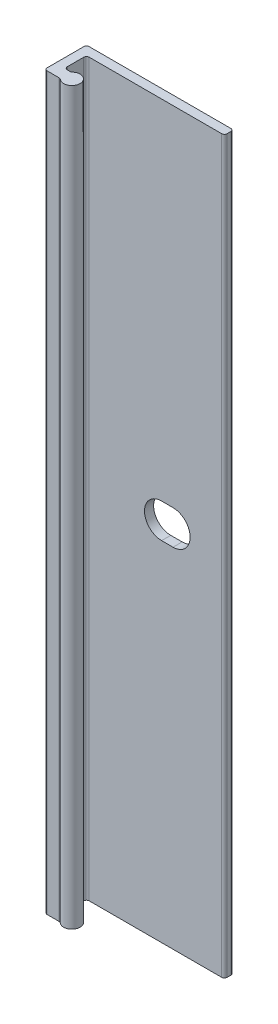
ISO-10303-21;
HEADER;
FILE_DESCRIPTION(('STEP AP214'),'2;1');
FILE_NAME('part.step','',(''),(''),'','','');
FILE_SCHEMA(('AUTOMOTIVE_DESIGN { 1 0 10303 214 1 1 1 1 }'));
ENDSEC;
DATA;
#1=APPLICATION_CONTEXT('core data for automotive mechanical design processes');
#2=APPLICATION_PROTOCOL_DEFINITION('international standard','automotive_design',2000,#1);
#3=PRODUCT_CONTEXT('',#1,'mechanical');
#4=PRODUCT('Part','Part','',(#3));
#5=PRODUCT_RELATED_PRODUCT_CATEGORY('part','',(#4));
#6=PRODUCT_DEFINITION_FORMATION('','',#4);
#7=PRODUCT_DEFINITION_CONTEXT('part definition',#1,'design');
#8=PRODUCT_DEFINITION('design','',#6,#7);
#9=PRODUCT_DEFINITION_SHAPE('','',#8);
#10=(LENGTH_UNIT() NAMED_UNIT(*) SI_UNIT(.MILLI.,.METRE.));
#11=(NAMED_UNIT(*) PLANE_ANGLE_UNIT() SI_UNIT($,.RADIAN.));
#12=(NAMED_UNIT(*) SI_UNIT($,.STERADIAN.) SOLID_ANGLE_UNIT());
#13=UNCERTAINTY_MEASURE_WITH_UNIT(LENGTH_MEASURE(1.E-05),#10,'distance_accuracy_value','');
#14=(GEOMETRIC_REPRESENTATION_CONTEXT(3) GLOBAL_UNCERTAINTY_ASSIGNED_CONTEXT((#13)) GLOBAL_UNIT_ASSIGNED_CONTEXT((#10,
#11,#12)) REPRESENTATION_CONTEXT('',''));
#15=CARTESIAN_POINT('',(0.,0.,0.));
#16=DIRECTION('',(0.,0.,1.));
#17=DIRECTION('',(1.,0.,0.));
#18=AXIS2_PLACEMENT_3D('',#15,#16,#17);
#19=CARTESIAN_POINT('',(0.381000000000001,50.8,5.461));
#20=DIRECTION('',(0.,-1.,0.));
#21=DIRECTION('',(0.,0.,-1.));
#22=AXIS2_PLACEMENT_3D('',#19,#20,#21);
#23=CYLINDRICAL_SURFACE('',#22,0.381);
#24=CARTESIAN_POINT('',(0.381000000000001,-50.8,5.461));
#25=DIRECTION('',(0.,1.,0.));
#26=DIRECTION('',(0.,0.,-1.));
#27=AXIS2_PLACEMENT_3D('',#24,#25,#26);
#28=CIRCLE('',#27,0.381);
#29=CARTESIAN_POINT('',(0.,-50.8,5.461));
#30=VERTEX_POINT('',#29);
#31=CARTESIAN_POINT('',(0.381000000000004,-50.8,5.842));
#32=VERTEX_POINT('',#31);
#33=EDGE_CURVE('E215',#30,#32,#28,.T.);
#34=ORIENTED_EDGE('',*,*,#33,.T.);
#35=DIRECTION('',(0.,-1.,0.));
#36=VECTOR('',#35,1.);
#37=CARTESIAN_POINT('',(0.381000000000004,50.8,5.842));
#38=LINE('',#37,#36);
#39=CARTESIAN_POINT('',(0.381000000000004,50.8,5.842));
#40=VERTEX_POINT('',#39);
#41=EDGE_CURVE('E13',#40,#32,#38,.T.);
#42=ORIENTED_EDGE('',*,*,#41,.F.);
#43=CARTESIAN_POINT('',(0.381000000000001,50.8,5.461));
#44=DIRECTION('',(0.,1.,0.));
#45=DIRECTION('',(0.,0.,-1.));
#46=AXIS2_PLACEMENT_3D('',#43,#44,#45);
#47=CIRCLE('',#46,0.381);
#48=CARTESIAN_POINT('',(0.,50.8,5.461));
#49=VERTEX_POINT('',#48);
#50=EDGE_CURVE('E219',#49,#40,#47,.T.);
#51=ORIENTED_EDGE('',*,*,#50,.F.);
#52=DIRECTION('',(0.,-1.,0.));
#53=VECTOR('',#52,1.);
#54=CARTESIAN_POINT('',(0.,50.8,5.461));
#55=LINE('',#54,#53);
#56=EDGE_CURVE('E253',#49,#30,#55,.T.);
#57=ORIENTED_EDGE('',*,*,#56,.T.);
#58=EDGE_LOOP('',(#34,#42,#51,#57));
#59=FACE_BOUND('',#58,.T.);
#60=ADVANCED_FACE('F46',(#59),#23,.T.);
#61=CARTESIAN_POINT('',(0.381000000000004,50.8,5.842));
#62=DIRECTION('',(0.,0.,-1.));
#63=DIRECTION('',(-1.,0.,0.));
#64=AXIS2_PLACEMENT_3D('',#61,#62,#63);
#65=PLANE('',#64);
#66=DIRECTION('',(1.,0.,0.));
#67=VECTOR('',#66,1.);
#68=CARTESIAN_POINT('',(0.381000000000004,-50.8,5.842));
#69=LINE('',#68,#67);
#70=CARTESIAN_POINT('',(2.03996875048439,-50.8,5.842));
#71=VERTEX_POINT('',#70);
#72=EDGE_CURVE('E256',#32,#71,#69,.T.);
#73=ORIENTED_EDGE('',*,*,#72,.T.);
#74=DIRECTION('',(0.,-1.,0.));
#75=VECTOR('',#74,1.);
#76=CARTESIAN_POINT('',(2.03996875048439,50.8,5.842));
#77=LINE('',#76,#75);
#78=CARTESIAN_POINT('',(2.03996875048439,50.8,5.842));
#79=VERTEX_POINT('',#78);
#80=EDGE_CURVE('E53',#79,#71,#77,.T.);
#81=ORIENTED_EDGE('',*,*,#80,.F.);
#82=DIRECTION('',(1.,0.,0.));
#83=VECTOR('',#82,1.);
#84=CARTESIAN_POINT('',(0.381000000000004,50.8,5.842));
#85=LINE('',#84,#83);
#86=EDGE_CURVE('E222',#40,#79,#85,.T.);
#87=ORIENTED_EDGE('',*,*,#86,.F.);
#88=ORIENTED_EDGE('',*,*,#41,.T.);
#89=EDGE_LOOP('',(#73,#81,#87,#88));
#90=FACE_BOUND('',#89,.T.);
#91=ADVANCED_FACE('F353',(#90),#65,.F.);
#92=CARTESIAN_POINT('',(2.03996875048439,50.8,6.223));
#93=DIRECTION('',(0.,-1.,0.));
#94=DIRECTION('',(0.,0.,-1.));
#95=AXIS2_PLACEMENT_3D('',#92,#93,#94);
#96=CYLINDRICAL_SURFACE('',#95,0.381);
#97=CARTESIAN_POINT('',(2.03996875048439,-50.8,6.223));
#98=DIRECTION('',(0.,-1.,0.));
#99=DIRECTION('',(0.,0.,-1.));
#100=AXIS2_PLACEMENT_3D('',#97,#98,#99);
#101=CIRCLE('',#100,0.381);
#102=CARTESIAN_POINT('',(2.29197656286329,-50.8,5.93725));
#103=VERTEX_POINT('',#102);
#104=EDGE_CURVE('E258',#71,#103,#101,.T.);
#105=ORIENTED_EDGE('',*,*,#104,.T.);
#106=DIRECTION('',(0.,-1.,0.));
#107=VECTOR('',#106,1.);
#108=CARTESIAN_POINT('',(2.29197656286329,50.8,5.93725));
#109=LINE('',#108,#107);
#110=CARTESIAN_POINT('',(2.29197656286329,50.8,5.93725));
#111=VERTEX_POINT('',#110);
#112=EDGE_CURVE('E323',#111,#103,#109,.T.);
#113=ORIENTED_EDGE('',*,*,#112,.F.);
#114=CARTESIAN_POINT('',(2.03996875048439,50.8,6.223));
#115=DIRECTION('',(0.,-1.,0.));
#116=DIRECTION('',(0.,0.,-1.));
#117=AXIS2_PLACEMENT_3D('',#114,#115,#116);
#118=CIRCLE('',#117,0.381);
#119=EDGE_CURVE('E225',#79,#111,#118,.T.);
#120=ORIENTED_EDGE('',*,*,#119,.F.);
#121=ORIENTED_EDGE('',*,*,#80,.T.);
#122=EDGE_LOOP('',(#105,#113,#120,#121));
#123=FACE_BOUND('',#122,.T.);
#124=ADVANCED_FACE('F330',(#123),#96,.F.);
#125=CARTESIAN_POINT('',(3.048,50.8,5.08));
#126=DIRECTION('',(0.,-1.,0.));
#127=DIRECTION('',(0.,0.,-1.));
#128=AXIS2_PLACEMENT_3D('',#125,#126,#127);
#129=CYLINDRICAL_SURFACE('',#128,1.143);
#130=CARTESIAN_POINT('',(3.048,-50.8,5.08));
#131=DIRECTION('',(0.,1.,0.));
#132=DIRECTION('',(0.,0.,1.));
#133=AXIS2_PLACEMENT_3D('',#130,#131,#132);
#134=CIRCLE('',#133,1.143);
#135=CARTESIAN_POINT('',(2.2919765628633,-50.8,4.22275));
#136=VERTEX_POINT('',#135);
#137=EDGE_CURVE('E260',#103,#136,#134,.T.);
#138=ORIENTED_EDGE('',*,*,#137,.T.);
#139=DIRECTION('',(0.,-1.,0.));
#140=VECTOR('',#139,1.);
#141=CARTESIAN_POINT('',(2.2919765628633,50.8,4.22275));
#142=LINE('',#141,#140);
#143=CARTESIAN_POINT('',(2.2919765628633,50.8,4.22275));
#144=VERTEX_POINT('',#143);
#145=EDGE_CURVE('E320',#144,#136,#142,.T.);
#146=ORIENTED_EDGE('',*,*,#145,.F.);
#147=CARTESIAN_POINT('',(3.048,50.8,5.08));
#148=DIRECTION('',(0.,1.,0.));
#149=DIRECTION('',(0.,0.,1.));
#150=AXIS2_PLACEMENT_3D('',#147,#148,#149);
#151=CIRCLE('',#150,1.143);
#152=EDGE_CURVE('E227',#111,#144,#151,.T.);
#153=ORIENTED_EDGE('',*,*,#152,.F.);
#154=ORIENTED_EDGE('',*,*,#112,.T.);
#155=EDGE_LOOP('',(#138,#146,#153,#154));
#156=FACE_BOUND('',#155,.T.);
#157=ADVANCED_FACE('F341',(#156),#129,.T.);
#158=CARTESIAN_POINT('',(2.03996875048439,50.8,3.937));
#159=DIRECTION('',(0.,-1.,0.));
#160=DIRECTION('',(0.,0.,-1.));
#161=AXIS2_PLACEMENT_3D('',#158,#159,#160);
#162=CYLINDRICAL_SURFACE('',#161,0.381000000000001);
#163=CARTESIAN_POINT('',(2.03996875048439,-50.8,3.937));
#164=DIRECTION('',(0.,-1.,0.));
#165=DIRECTION('',(0.,0.,-1.));
#166=AXIS2_PLACEMENT_3D('',#163,#164,#165);
#167=CIRCLE('',#166,0.381000000000001);
#168=CARTESIAN_POINT('',(2.03996875048439,-50.8,4.318));
#169=VERTEX_POINT('',#168);
#170=EDGE_CURVE('E262',#136,#169,#167,.T.);
#171=ORIENTED_EDGE('',*,*,#170,.T.);
#172=DIRECTION('',(0.,-1.,0.));
#173=VECTOR('',#172,1.);
#174=CARTESIAN_POINT('',(2.03996875048439,50.8,4.318));
#175=LINE('',#174,#173);
#176=CARTESIAN_POINT('',(2.03996875048439,50.8,4.318));
#177=VERTEX_POINT('',#176);
#178=EDGE_CURVE('E317',#177,#169,#175,.T.);
#179=ORIENTED_EDGE('',*,*,#178,.F.);
#180=CARTESIAN_POINT('',(2.03996875048439,50.8,3.937));
#181=DIRECTION('',(0.,-1.,0.));
#182=DIRECTION('',(0.,0.,-1.));
#183=AXIS2_PLACEMENT_3D('',#180,#181,#182);
#184=CIRCLE('',#183,0.381000000000001);
#185=EDGE_CURVE('E229',#144,#177,#184,.T.);
#186=ORIENTED_EDGE('',*,*,#185,.F.);
#187=ORIENTED_EDGE('',*,*,#145,.T.);
#188=EDGE_LOOP('',(#171,#179,#186,#187));
#189=FACE_BOUND('',#188,.T.);
#190=ADVANCED_FACE('F345',(#189),#162,.F.);
#191=CARTESIAN_POINT('',(1.651,50.8,4.318));
#192=DIRECTION('',(0.,0.,1.));
#193=DIRECTION('',(1.,0.,0.));
#194=AXIS2_PLACEMENT_3D('',#191,#192,#193);
#195=PLANE('',#194);
#196=DIRECTION('',(-1.,0.,0.));
#197=VECTOR('',#196,1.);
#198=CARTESIAN_POINT('',(1.651,-50.8,4.318));
#199=LINE('',#198,#197);
#200=CARTESIAN_POINT('',(1.651,-50.8,4.318));
#201=VERTEX_POINT('',#200);
#202=EDGE_CURVE('E264',#169,#201,#199,.T.);
#203=ORIENTED_EDGE('',*,*,#202,.T.);
#204=DIRECTION('',(0.,-1.,0.));
#205=VECTOR('',#204,1.);
#206=CARTESIAN_POINT('',(1.651,50.8,4.318));
#207=LINE('',#206,#205);
#208=CARTESIAN_POINT('',(1.651,50.8,4.318));
#209=VERTEX_POINT('',#208);
#210=EDGE_CURVE('E314',#209,#201,#207,.T.);
#211=ORIENTED_EDGE('',*,*,#210,.F.);
#212=DIRECTION('',(-1.,0.,0.));
#213=VECTOR('',#212,1.);
#214=CARTESIAN_POINT('',(1.651,50.8,4.318));
#215=LINE('',#214,#213);
#216=EDGE_CURVE('E231',#177,#209,#215,.T.);
#217=ORIENTED_EDGE('',*,*,#216,.F.);
#218=ORIENTED_EDGE('',*,*,#178,.T.);
#219=EDGE_LOOP('',(#203,#211,#217,#218));
#220=FACE_BOUND('',#219,.T.);
#221=ADVANCED_FACE('F404',(#220),#195,.F.);
#222=CARTESIAN_POINT('',(1.651,50.8,3.937));
#223=DIRECTION('',(0.,-1.,0.));
#224=DIRECTION('',(0.,0.,-1.));
#225=AXIS2_PLACEMENT_3D('',#222,#223,#224);
#226=CYLINDRICAL_SURFACE('',#225,0.381);
#227=CARTESIAN_POINT('',(1.651,-50.8,3.937));
#228=DIRECTION('',(0.,-1.,0.));
#229=DIRECTION('',(0.,0.,1.));
#230=AXIS2_PLACEMENT_3D('',#227,#228,#229);
#231=CIRCLE('',#230,0.381);
#232=CARTESIAN_POINT('',(1.27,-50.8,3.937));
#233=VERTEX_POINT('',#232);
#234=EDGE_CURVE('E266',#201,#233,#231,.T.);
#235=ORIENTED_EDGE('',*,*,#234,.T.);
#236=DIRECTION('',(0.,-1.,0.));
#237=VECTOR('',#236,1.);
#238=CARTESIAN_POINT('',(1.27,50.8,3.937));
#239=LINE('',#238,#237);
#240=CARTESIAN_POINT('',(1.27,50.8,3.937));
#241=VERTEX_POINT('',#240);
#242=EDGE_CURVE('E311',#241,#233,#239,.T.);
#243=ORIENTED_EDGE('',*,*,#242,.F.);
#244=CARTESIAN_POINT('',(1.651,50.8,3.937));
#245=DIRECTION('',(0.,-1.,0.));
#246=DIRECTION('',(0.,0.,1.));
#247=AXIS2_PLACEMENT_3D('',#244,#245,#246);
#248=CIRCLE('',#247,0.381);
#249=EDGE_CURVE('E233',#209,#241,#248,.T.);
#250=ORIENTED_EDGE('',*,*,#249,.F.);
#251=ORIENTED_EDGE('',*,*,#210,.T.);
#252=EDGE_LOOP('',(#235,#243,#250,#251));
#253=FACE_BOUND('',#252,.T.);
#254=ADVANCED_FACE('F401',(#253),#226,.F.);
#255=CARTESIAN_POINT('',(1.27,50.8,1.651));
#256=DIRECTION('',(-1.,0.,0.));
#257=DIRECTION('',(0.,0.,1.));
#258=AXIS2_PLACEMENT_3D('',#255,#256,#257);
#259=PLANE('',#258);
#260=DIRECTION('',(0.,0.,-1.));
#261=VECTOR('',#260,1.);
#262=CARTESIAN_POINT('',(1.27,-50.8,1.651));
#263=LINE('',#262,#261);
#264=CARTESIAN_POINT('',(1.27,-50.8,1.651));
#265=VERTEX_POINT('',#264);
#266=EDGE_CURVE('E268',#233,#265,#263,.T.);
#267=ORIENTED_EDGE('',*,*,#266,.T.);
#268=DIRECTION('',(0.,-1.,0.));
#269=VECTOR('',#268,1.);
#270=CARTESIAN_POINT('',(1.27,50.8,1.651));
#271=LINE('',#270,#269);
#272=CARTESIAN_POINT('',(1.27,50.8,1.651));
#273=VERTEX_POINT('',#272);
#274=EDGE_CURVE('E308',#273,#265,#271,.T.);
#275=ORIENTED_EDGE('',*,*,#274,.F.);
#276=DIRECTION('',(0.,0.,-1.));
#277=VECTOR('',#276,1.);
#278=CARTESIAN_POINT('',(1.27,50.8,1.651));
#279=LINE('',#278,#277);
#280=EDGE_CURVE('E235',#241,#273,#279,.T.);
#281=ORIENTED_EDGE('',*,*,#280,.F.);
#282=ORIENTED_EDGE('',*,*,#242,.T.);
#283=EDGE_LOOP('',(#267,#275,#281,#282));
#284=FACE_BOUND('',#283,.T.);
#285=ADVANCED_FACE('F397',(#284),#259,.F.);
#286=CARTESIAN_POINT('',(1.651,50.8,1.651));
#287=DIRECTION('',(0.,-1.,0.));
#288=DIRECTION('',(0.,0.,-1.));
#289=AXIS2_PLACEMENT_3D('',#286,#287,#288);
#290=CYLINDRICAL_SURFACE('',#289,0.381);
#291=CARTESIAN_POINT('',(1.651,-50.8,1.651));
#292=DIRECTION('',(0.,-1.,0.));
#293=DIRECTION('',(0.,0.,1.));
#294=AXIS2_PLACEMENT_3D('',#291,#292,#293);
#295=CIRCLE('',#294,0.381);
#296=CARTESIAN_POINT('',(1.651,-50.8,1.27));
#297=VERTEX_POINT('',#296);
#298=EDGE_CURVE('E270',#265,#297,#295,.T.);
#299=ORIENTED_EDGE('',*,*,#298,.T.);
#300=DIRECTION('',(0.,-1.,0.));
#301=VECTOR('',#300,1.);
#302=CARTESIAN_POINT('',(1.651,50.8,1.27));
#303=LINE('',#302,#301);
#304=CARTESIAN_POINT('',(1.651,50.8,1.27));
#305=VERTEX_POINT('',#304);
#306=EDGE_CURVE('E305',#305,#297,#303,.T.);
#307=ORIENTED_EDGE('',*,*,#306,.F.);
#308=CARTESIAN_POINT('',(1.651,50.8,1.651));
#309=DIRECTION('',(0.,-1.,0.));
#310=DIRECTION('',(0.,0.,1.));
#311=AXIS2_PLACEMENT_3D('',#308,#309,#310);
#312=CIRCLE('',#311,0.381);
#313=EDGE_CURVE('E237',#273,#305,#312,.T.);
#314=ORIENTED_EDGE('',*,*,#313,.F.);
#315=ORIENTED_EDGE('',*,*,#274,.T.);
#316=EDGE_LOOP('',(#299,#307,#314,#315));
#317=FACE_BOUND('',#316,.T.);
#318=ADVANCED_FACE('F393',(#317),#290,.F.);
#319=CARTESIAN_POINT('',(20.066,50.8,1.27));
#320=DIRECTION('',(0.,0.,-1.));
#321=DIRECTION('',(-1.,0.,0.));
#322=AXIS2_PLACEMENT_3D('',#319,#320,#321);
#323=PLANE('',#322);
#324=DIRECTION('',(1.,0.,0.));
#325=VECTOR('',#324,1.);
#326=CARTESIAN_POINT('',(11.71575,-2.38125,1.27));
#327=LINE('',#326,#325);
#328=CARTESIAN_POINT('',(11.71575,-2.38125,1.27));
#329=VERTEX_POINT('',#328);
#330=CARTESIAN_POINT('',(13.30325,-2.38125,1.27));
#331=VERTEX_POINT('',#330);
#332=EDGE_CURVE('E209',#329,#331,#327,.T.);
#333=ORIENTED_EDGE('',*,*,#332,.F.);
#334=CARTESIAN_POINT('',(11.71575,0.,1.27));
#335=DIRECTION('',(0.,0.,1.));
#336=DIRECTION('',(1.,0.,0.));
#337=AXIS2_PLACEMENT_3D('',#334,#335,#336);
#338=CIRCLE('',#337,2.38125);
#339=CARTESIAN_POINT('',(11.71575,2.38125,1.27));
#340=VERTEX_POINT('',#339);
#341=EDGE_CURVE('E60',#340,#329,#338,.T.);
#342=ORIENTED_EDGE('',*,*,#341,.F.);
#343=DIRECTION('',(-1.,0.,0.));
#344=VECTOR('',#343,1.);
#345=CARTESIAN_POINT('',(11.71575,2.38125,1.27));
#346=LINE('',#345,#344);
#347=CARTESIAN_POINT('',(13.30325,2.38125,1.27));
#348=VERTEX_POINT('',#347);
#349=EDGE_CURVE('E200',#348,#340,#346,.T.);
#350=ORIENTED_EDGE('',*,*,#349,.F.);
#351=CARTESIAN_POINT('',(13.30325,0.,1.27));
#352=DIRECTION('',(0.,0.,1.));
#353=DIRECTION('',(1.,0.,0.));
#354=AXIS2_PLACEMENT_3D('',#351,#352,#353);
#355=CIRCLE('',#354,2.38125);
#356=EDGE_CURVE('E203',#331,#348,#355,.T.);
#357=ORIENTED_EDGE('',*,*,#356,.F.);
#358=EDGE_LOOP('',(#333,#342,#350,#357));
#359=FACE_BOUND('',#358,.T.);
#360=DIRECTION('',(1.,0.,0.));
#361=VECTOR('',#360,1.);
#362=CARTESIAN_POINT('',(20.066,-50.8,1.27));
#363=LINE('',#362,#361);
#364=CARTESIAN_POINT('',(20.066,-50.8,1.27));
#365=VERTEX_POINT('',#364);
#366=EDGE_CURVE('E272',#297,#365,#363,.T.);
#367=ORIENTED_EDGE('',*,*,#366,.T.);
#368=DIRECTION('',(0.,-1.,0.));
#369=VECTOR('',#368,1.);
#370=CARTESIAN_POINT('',(20.066,50.8,1.27));
#371=LINE('',#370,#369);
#372=CARTESIAN_POINT('',(20.066,50.8,1.27));
#373=VERTEX_POINT('',#372);
#374=EDGE_CURVE('E302',#373,#365,#371,.T.);
#375=ORIENTED_EDGE('',*,*,#374,.F.);
#376=DIRECTION('',(1.,0.,0.));
#377=VECTOR('',#376,1.);
#378=CARTESIAN_POINT('',(20.066,50.8,1.27));
#379=LINE('',#378,#377);
#380=EDGE_CURVE('E239',#305,#373,#379,.T.);
#381=ORIENTED_EDGE('',*,*,#380,.F.);
#382=ORIENTED_EDGE('',*,*,#306,.T.);
#383=EDGE_LOOP('',(#367,#375,#381,#382));
#384=FACE_BOUND('',#383,.T.);
#385=ADVANCED_FACE('F388',(#359,#384),#323,.F.);
#386=CARTESIAN_POINT('',(20.066,50.8,0.889));
#387=DIRECTION('',(0.,-1.,0.));
#388=DIRECTION('',(0.,0.,-1.));
#389=AXIS2_PLACEMENT_3D('',#386,#387,#388);
#390=CYLINDRICAL_SURFACE('',#389,0.380999999999999);
#391=CARTESIAN_POINT('',(20.066,-50.8,0.889));
#392=DIRECTION('',(0.,1.,0.));
#393=DIRECTION('',(0.,0.,-1.));
#394=AXIS2_PLACEMENT_3D('',#391,#392,#393);
#395=CIRCLE('',#394,0.380999999999999);
#396=CARTESIAN_POINT('',(20.447,-50.8,0.889));
#397=VERTEX_POINT('',#396);
#398=EDGE_CURVE('E274',#365,#397,#395,.T.);
#399=ORIENTED_EDGE('',*,*,#398,.T.);
#400=DIRECTION('',(0.,-1.,0.));
#401=VECTOR('',#400,1.);
#402=CARTESIAN_POINT('',(20.447,50.8,0.889));
#403=LINE('',#402,#401);
#404=CARTESIAN_POINT('',(20.447,50.8,0.889));
#405=VERTEX_POINT('',#404);
#406=EDGE_CURVE('E299',#405,#397,#403,.T.);
#407=ORIENTED_EDGE('',*,*,#406,.F.);
#408=CARTESIAN_POINT('',(20.066,50.8,0.889));
#409=DIRECTION('',(0.,1.,0.));
#410=DIRECTION('',(0.,0.,-1.));
#411=AXIS2_PLACEMENT_3D('',#408,#409,#410);
#412=CIRCLE('',#411,0.380999999999999);
#413=EDGE_CURVE('E241',#373,#405,#412,.T.);
#414=ORIENTED_EDGE('',*,*,#413,.F.);
#415=ORIENTED_EDGE('',*,*,#374,.T.);
#416=EDGE_LOOP('',(#399,#407,#414,#415));
#417=FACE_BOUND('',#416,.T.);
#418=ADVANCED_FACE('F382',(#417),#390,.T.);
#419=CARTESIAN_POINT('',(20.447,50.8,0.381));
#420=DIRECTION('',(-1.,0.,0.));
#421=DIRECTION('',(0.,0.,1.));
#422=AXIS2_PLACEMENT_3D('',#419,#420,#421);
#423=PLANE('',#422);
#424=DIRECTION('',(0.,0.,-1.));
#425=VECTOR('',#424,1.);
#426=CARTESIAN_POINT('',(20.447,-50.8,0.381));
#427=LINE('',#426,#425);
#428=CARTESIAN_POINT('',(20.447,-50.8,0.381));
#429=VERTEX_POINT('',#428);
#430=EDGE_CURVE('E276',#397,#429,#427,.T.);
#431=ORIENTED_EDGE('',*,*,#430,.T.);
#432=DIRECTION('',(0.,-1.,0.));
#433=VECTOR('',#432,1.);
#434=CARTESIAN_POINT('',(20.447,50.8,0.381));
#435=LINE('',#434,#433);
#436=CARTESIAN_POINT('',(20.447,50.8,0.381));
#437=VERTEX_POINT('',#436);
#438=EDGE_CURVE('E296',#437,#429,#435,.T.);
#439=ORIENTED_EDGE('',*,*,#438,.F.);
#440=DIRECTION('',(0.,0.,-1.));
#441=VECTOR('',#440,1.);
#442=CARTESIAN_POINT('',(20.447,50.8,0.381));
#443=LINE('',#442,#441);
#444=EDGE_CURVE('E243',#405,#437,#443,.T.);
#445=ORIENTED_EDGE('',*,*,#444,.F.);
#446=ORIENTED_EDGE('',*,*,#406,.T.);
#447=EDGE_LOOP('',(#431,#439,#445,#446));
#448=FACE_BOUND('',#447,.T.);
#449=ADVANCED_FACE('F378',(#448),#423,.F.);
#450=CARTESIAN_POINT('',(20.066,50.8,0.381));
#451=DIRECTION('',(0.,-1.,0.));
#452=DIRECTION('',(0.,0.,-1.));
#453=AXIS2_PLACEMENT_3D('',#450,#451,#452);
#454=CYLINDRICAL_SURFACE('',#453,0.381);
#455=CARTESIAN_POINT('',(20.066,-50.8,0.381));
#456=DIRECTION('',(0.,1.,0.));
#457=DIRECTION('',(0.,0.,-1.));
#458=AXIS2_PLACEMENT_3D('',#455,#456,#457);
#459=CIRCLE('',#458,0.381);
#460=CARTESIAN_POINT('',(20.066,-50.8,0.));
#461=VERTEX_POINT('',#460);
#462=EDGE_CURVE('E278',#429,#461,#459,.T.);
#463=ORIENTED_EDGE('',*,*,#462,.T.);
#464=DIRECTION('',(0.,-1.,0.));
#465=VECTOR('',#464,1.);
#466=CARTESIAN_POINT('',(20.066,50.8,0.));
#467=LINE('',#466,#465);
#468=CARTESIAN_POINT('',(20.066,50.8,0.));
#469=VERTEX_POINT('',#468);
#470=EDGE_CURVE('E293',#469,#461,#467,.T.);
#471=ORIENTED_EDGE('',*,*,#470,.F.);
#472=CARTESIAN_POINT('',(20.066,50.8,0.381));
#473=DIRECTION('',(0.,1.,0.));
#474=DIRECTION('',(0.,0.,-1.));
#475=AXIS2_PLACEMENT_3D('',#472,#473,#474);
#476=CIRCLE('',#475,0.381);
#477=EDGE_CURVE('E245',#437,#469,#476,.T.);
#478=ORIENTED_EDGE('',*,*,#477,.F.);
#479=ORIENTED_EDGE('',*,*,#438,.T.);
#480=EDGE_LOOP('',(#463,#471,#478,#479));
#481=FACE_BOUND('',#480,.T.);
#482=ADVANCED_FACE('F373',(#481),#454,.T.);
#483=CARTESIAN_POINT('',(0.381000000000003,50.8,0.));
#484=DIRECTION('',(0.,0.,1.));
#485=DIRECTION('',(1.,0.,0.));
#486=AXIS2_PLACEMENT_3D('',#483,#484,#485);
#487=PLANE('',#486);
#488=DIRECTION('',(-1.,0.,0.));
#489=VECTOR('',#488,1.);
#490=CARTESIAN_POINT('',(11.71575,2.38125,0.));
#491=LINE('',#490,#489);
#492=CARTESIAN_POINT('',(13.30325,2.38125,0.));
#493=VERTEX_POINT('',#492);
#494=CARTESIAN_POINT('',(11.71575,2.38125,0.));
#495=VERTEX_POINT('',#494);
#496=EDGE_CURVE('E190',#493,#495,#491,.T.);
#497=ORIENTED_EDGE('',*,*,#496,.T.);
#498=CARTESIAN_POINT('',(11.71575,0.,0.));
#499=DIRECTION('',(0.,0.,1.));
#500=DIRECTION('',(1.,0.,0.));
#501=AXIS2_PLACEMENT_3D('',#498,#499,#500);
#502=CIRCLE('',#501,2.38125);
#503=CARTESIAN_POINT('',(11.71575,-2.38125,0.));
#504=VERTEX_POINT('',#503);
#505=EDGE_CURVE('E184',#495,#504,#502,.T.);
#506=ORIENTED_EDGE('',*,*,#505,.T.);
#507=DIRECTION('',(1.,0.,0.));
#508=VECTOR('',#507,1.);
#509=CARTESIAN_POINT('',(11.71575,-2.38125,0.));
#510=LINE('',#509,#508);
#511=CARTESIAN_POINT('',(13.30325,-2.38125,0.));
#512=VERTEX_POINT('',#511);
#513=EDGE_CURVE('E193',#504,#512,#510,.T.);
#514=ORIENTED_EDGE('',*,*,#513,.T.);
#515=CARTESIAN_POINT('',(13.30325,0.,0.));
#516=DIRECTION('',(0.,0.,1.));
#517=DIRECTION('',(1.,0.,0.));
#518=AXIS2_PLACEMENT_3D('',#515,#516,#517);
#519=CIRCLE('',#518,2.38125);
#520=EDGE_CURVE('E68',#512,#493,#519,.T.);
#521=ORIENTED_EDGE('',*,*,#520,.T.);
#522=EDGE_LOOP('',(#497,#506,#514,#521));
#523=FACE_BOUND('',#522,.T.);
#524=DIRECTION('',(-1.,0.,0.));
#525=VECTOR('',#524,1.);
#526=CARTESIAN_POINT('',(0.381000000000003,-50.8,0.));
#527=LINE('',#526,#525);
#528=CARTESIAN_POINT('',(0.381000000000003,-50.8,0.));
#529=VERTEX_POINT('',#528);
#530=EDGE_CURVE('E280',#461,#529,#527,.T.);
#531=ORIENTED_EDGE('',*,*,#530,.T.);
#532=DIRECTION('',(0.,-1.,0.));
#533=VECTOR('',#532,1.);
#534=CARTESIAN_POINT('',(0.381000000000003,50.8,0.));
#535=LINE('',#534,#533);
#536=CARTESIAN_POINT('',(0.381000000000003,50.8,0.));
#537=VERTEX_POINT('',#536);
#538=EDGE_CURVE('E290',#537,#529,#535,.T.);
#539=ORIENTED_EDGE('',*,*,#538,.F.);
#540=DIRECTION('',(-1.,0.,0.));
#541=VECTOR('',#540,1.);
#542=CARTESIAN_POINT('',(0.381000000000003,50.8,0.));
#543=LINE('',#542,#541);
#544=EDGE_CURVE('E247',#469,#537,#543,.T.);
#545=ORIENTED_EDGE('',*,*,#544,.F.);
#546=ORIENTED_EDGE('',*,*,#470,.T.);
#547=EDGE_LOOP('',(#531,#539,#545,#546));
#548=FACE_BOUND('',#547,.T.);
#549=ADVANCED_FACE('F197',(#523,#548),#487,.F.);
#550=CARTESIAN_POINT('',(0.381,50.8,0.381));
#551=DIRECTION('',(0.,-1.,0.));
#552=DIRECTION('',(0.,0.,-1.));
#553=AXIS2_PLACEMENT_3D('',#550,#551,#552);
#554=CYLINDRICAL_SURFACE('',#553,0.381);
#555=CARTESIAN_POINT('',(0.381,-50.8,0.381));
#556=DIRECTION('',(0.,1.,0.));
#557=DIRECTION('',(0.,0.,1.));
#558=AXIS2_PLACEMENT_3D('',#555,#556,#557);
#559=CIRCLE('',#558,0.381);
#560=CARTESIAN_POINT('',(0.,-50.8,0.381000000000003));
#561=VERTEX_POINT('',#560);
#562=EDGE_CURVE('E282',#529,#561,#559,.T.);
#563=ORIENTED_EDGE('',*,*,#562,.T.);
#564=DIRECTION('',(0.,-1.,0.));
#565=VECTOR('',#564,1.);
#566=CARTESIAN_POINT('',(0.,50.8,0.381000000000003));
#567=LINE('',#566,#565);
#568=CARTESIAN_POINT('',(0.,50.8,0.381000000000003));
#569=VERTEX_POINT('',#568);
#570=EDGE_CURVE('E287',#569,#561,#567,.T.);
#571=ORIENTED_EDGE('',*,*,#570,.F.);
#572=CARTESIAN_POINT('',(0.381,50.8,0.381));
#573=DIRECTION('',(0.,1.,0.));
#574=DIRECTION('',(0.,0.,1.));
#575=AXIS2_PLACEMENT_3D('',#572,#573,#574);
#576=CIRCLE('',#575,0.381);
#577=EDGE_CURVE('E249',#537,#569,#576,.T.);
#578=ORIENTED_EDGE('',*,*,#577,.F.);
#579=ORIENTED_EDGE('',*,*,#538,.T.);
#580=EDGE_LOOP('',(#563,#571,#578,#579));
#581=FACE_BOUND('',#580,.T.);
#582=ADVANCED_FACE('F365',(#581),#554,.T.);
#583=CARTESIAN_POINT('',(0.,50.8,0.381000000000003));
#584=DIRECTION('',(1.,0.,0.));
#585=DIRECTION('',(0.,0.,-1.));
#586=AXIS2_PLACEMENT_3D('',#583,#584,#585);
#587=PLANE('',#586);
#588=DIRECTION('',(0.,0.,1.));
#589=VECTOR('',#588,1.);
#590=CARTESIAN_POINT('',(0.,-50.8,0.381000000000003));
#591=LINE('',#590,#589);
#592=EDGE_CURVE('E223',#561,#30,#591,.T.);
#593=ORIENTED_EDGE('',*,*,#592,.T.);
#594=ORIENTED_EDGE('',*,*,#56,.F.);
#595=DIRECTION('',(0.,0.,1.));
#596=VECTOR('',#595,1.);
#597=CARTESIAN_POINT('',(0.,50.8,0.381000000000003));
#598=LINE('',#597,#596);
#599=EDGE_CURVE('E251',#569,#49,#598,.T.);
#600=ORIENTED_EDGE('',*,*,#599,.F.);
#601=ORIENTED_EDGE('',*,*,#570,.T.);
#602=EDGE_LOOP('',(#593,#594,#600,#601));
#603=FACE_BOUND('',#602,.T.);
#604=ADVANCED_FACE('F360',(#603),#587,.F.);
#605=CARTESIAN_POINT('',(0.381000000000001,50.8,5.461));
#606=DIRECTION('',(0.,-1.,0.));
#607=DIRECTION('',(0.,0.,-1.));
#608=AXIS2_PLACEMENT_3D('',#605,#606,#607);
#609=PLANE('',#608);
#610=ORIENTED_EDGE('',*,*,#50,.T.);
#611=ORIENTED_EDGE('',*,*,#86,.T.);
#612=ORIENTED_EDGE('',*,*,#119,.T.);
#613=ORIENTED_EDGE('',*,*,#152,.T.);
#614=ORIENTED_EDGE('',*,*,#185,.T.);
#615=ORIENTED_EDGE('',*,*,#216,.T.);
#616=ORIENTED_EDGE('',*,*,#249,.T.);
#617=ORIENTED_EDGE('',*,*,#280,.T.);
#618=ORIENTED_EDGE('',*,*,#313,.T.);
#619=ORIENTED_EDGE('',*,*,#380,.T.);
#620=ORIENTED_EDGE('',*,*,#413,.T.);
#621=ORIENTED_EDGE('',*,*,#444,.T.);
#622=ORIENTED_EDGE('',*,*,#477,.T.);
#623=ORIENTED_EDGE('',*,*,#544,.T.);
#624=ORIENTED_EDGE('',*,*,#577,.T.);
#625=ORIENTED_EDGE('',*,*,#599,.T.);
#626=EDGE_LOOP('',(#610,#611,#612,#613,#614,#615,#616,#617,#618,#619,#620,#621,#622,#623,#624,#625));
#627=FACE_BOUND('',#626,.T.);
#628=ADVANCED_FACE('F349',(#627),#609,.F.);
#629=CARTESIAN_POINT('',(0.381000000000001,-50.8,5.461));
#630=DIRECTION('',(0.,-1.,0.));
#631=DIRECTION('',(0.,0.,-1.));
#632=AXIS2_PLACEMENT_3D('',#629,#630,#631);
#633=PLANE('',#632);
#634=ORIENTED_EDGE('',*,*,#33,.F.);
#635=ORIENTED_EDGE('',*,*,#592,.F.);
#636=ORIENTED_EDGE('',*,*,#562,.F.);
#637=ORIENTED_EDGE('',*,*,#530,.F.);
#638=ORIENTED_EDGE('',*,*,#462,.F.);
#639=ORIENTED_EDGE('',*,*,#430,.F.);
#640=ORIENTED_EDGE('',*,*,#398,.F.);
#641=ORIENTED_EDGE('',*,*,#366,.F.);
#642=ORIENTED_EDGE('',*,*,#298,.F.);
#643=ORIENTED_EDGE('',*,*,#266,.F.);
#644=ORIENTED_EDGE('',*,*,#234,.F.);
#645=ORIENTED_EDGE('',*,*,#202,.F.);
#646=ORIENTED_EDGE('',*,*,#170,.F.);
#647=ORIENTED_EDGE('',*,*,#137,.F.);
#648=ORIENTED_EDGE('',*,*,#104,.F.);
#649=ORIENTED_EDGE('',*,*,#72,.F.);
#650=EDGE_LOOP('',(#634,#635,#636,#637,#638,#639,#640,#641,#642,#643,#644,#645,#646,#647,#648,#649));
#651=FACE_BOUND('',#650,.T.);
#652=ADVANCED_FACE('F336',(#651),#633,.T.);
#653=CARTESIAN_POINT('',(11.71575,0.,0.));
#654=DIRECTION('',(0.,0.,1.));
#655=DIRECTION('',(1.,0.,0.));
#656=AXIS2_PLACEMENT_3D('',#653,#654,#655);
#657=CYLINDRICAL_SURFACE('',#656,2.38125);
#658=ORIENTED_EDGE('',*,*,#341,.T.);
#659=DIRECTION('',(0.,0.,1.));
#660=VECTOR('',#659,1.);
#661=CARTESIAN_POINT('',(11.71575,-2.38125,0.));
#662=LINE('',#661,#660);
#663=EDGE_CURVE('E180',#504,#329,#662,.T.);
#664=ORIENTED_EDGE('',*,*,#663,.F.);
#665=ORIENTED_EDGE('',*,*,#505,.F.);
#666=DIRECTION('',(0.,0.,1.));
#667=VECTOR('',#666,1.);
#668=CARTESIAN_POINT('',(11.71575,2.38125,0.));
#669=LINE('',#668,#667);
#670=EDGE_CURVE('E213',#495,#340,#669,.T.);
#671=ORIENTED_EDGE('',*,*,#670,.T.);
#672=EDGE_LOOP('',(#658,#664,#665,#671));
#673=FACE_BOUND('',#672,.T.);
#674=ADVANCED_FACE('F182',(#673),#657,.F.);
#675=CARTESIAN_POINT('',(11.71575,2.38125,0.));
#676=DIRECTION('',(0.,1.,0.));
#677=DIRECTION('',(-1.,0.,0.));
#678=AXIS2_PLACEMENT_3D('',#675,#676,#677);
#679=PLANE('',#678);
#680=ORIENTED_EDGE('',*,*,#349,.T.);
#681=ORIENTED_EDGE('',*,*,#670,.F.);
#682=ORIENTED_EDGE('',*,*,#496,.F.);
#683=DIRECTION('',(0.,0.,1.));
#684=VECTOR('',#683,1.);
#685=CARTESIAN_POINT('',(13.30325,2.38125,0.));
#686=LINE('',#685,#684);
#687=EDGE_CURVE('E216',#493,#348,#686,.T.);
#688=ORIENTED_EDGE('',*,*,#687,.T.);
#689=EDGE_LOOP('',(#680,#681,#682,#688));
#690=FACE_BOUND('',#689,.T.);
#691=ADVANCED_FACE('F539',(#690),#679,.F.);
#692=CARTESIAN_POINT('',(13.30325,0.,0.));
#693=DIRECTION('',(0.,0.,1.));
#694=DIRECTION('',(1.,0.,0.));
#695=AXIS2_PLACEMENT_3D('',#692,#693,#694);
#696=CYLINDRICAL_SURFACE('',#695,2.38125);
#697=ORIENTED_EDGE('',*,*,#356,.T.);
#698=ORIENTED_EDGE('',*,*,#687,.F.);
#699=ORIENTED_EDGE('',*,*,#520,.F.);
#700=DIRECTION('',(0.,0.,1.));
#701=VECTOR('',#700,1.);
#702=CARTESIAN_POINT('',(13.30325,-2.38125,0.));
#703=LINE('',#702,#701);
#704=EDGE_CURVE('E189',#512,#331,#703,.T.);
#705=ORIENTED_EDGE('',*,*,#704,.T.);
#706=EDGE_LOOP('',(#697,#698,#699,#705));
#707=FACE_BOUND('',#706,.T.);
#708=ADVANCED_FACE('F548',(#707),#696,.F.);
#709=CARTESIAN_POINT('',(11.71575,-2.38125,0.));
#710=DIRECTION('',(0.,-1.,0.));
#711=DIRECTION('',(1.,0.,0.));
#712=AXIS2_PLACEMENT_3D('',#709,#710,#711);
#713=PLANE('',#712);
#714=ORIENTED_EDGE('',*,*,#332,.T.);
#715=ORIENTED_EDGE('',*,*,#704,.F.);
#716=ORIENTED_EDGE('',*,*,#513,.F.);
#717=ORIENTED_EDGE('',*,*,#663,.T.);
#718=EDGE_LOOP('',(#714,#715,#716,#717));
#719=FACE_BOUND('',#718,.T.);
#720=ADVANCED_FACE('F194',(#719),#713,.F.);
#721=CLOSED_SHELL('',(#60,#91,#124,#157,#190,#221,#254,#285,#318,#385,#418,#449,#482,#549,#582,
#604,#628,#652,#674,#691,#708,#720));
#722=MANIFOLD_SOLID_BREP('B2',#721);
#723=ADVANCED_BREP_SHAPE_REPRESENTATION('',(#18,#722),#14);
#724=SHAPE_DEFINITION_REPRESENTATION(#9,#723);
ENDSEC;
END-ISO-10303-21;
